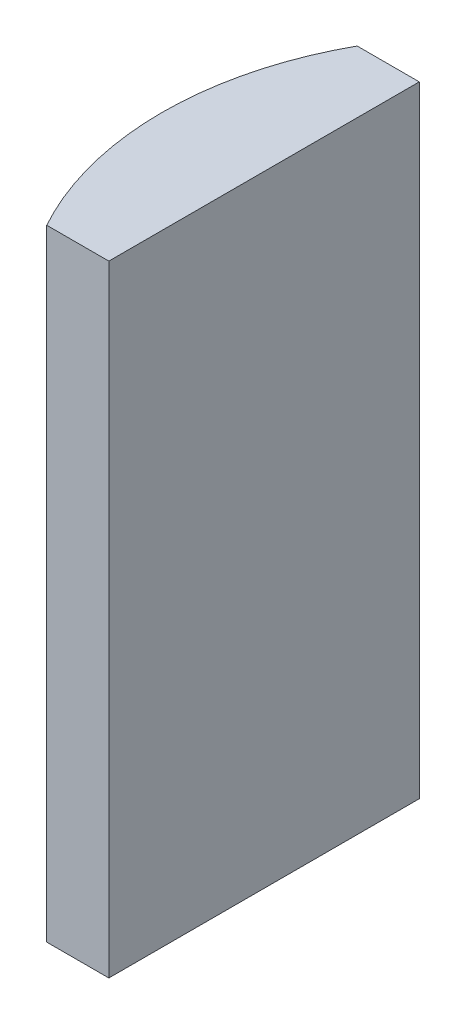
ISO-10303-21;
HEADER;
FILE_DESCRIPTION(('STEP AP214'),'2;1');
FILE_NAME('part.step','',(''),(''),'','','');
FILE_SCHEMA(('AUTOMOTIVE_DESIGN { 1 0 10303 214 1 1 1 1 }'));
ENDSEC;
DATA;
#1=APPLICATION_CONTEXT('core data for automotive mechanical design processes');
#2=APPLICATION_PROTOCOL_DEFINITION('international standard','automotive_design',2000,#1);
#3=PRODUCT_CONTEXT('',#1,'mechanical');
#4=PRODUCT('Part','Part','',(#3));
#5=PRODUCT_RELATED_PRODUCT_CATEGORY('part','',(#4));
#6=PRODUCT_DEFINITION_FORMATION('','',#4);
#7=PRODUCT_DEFINITION_CONTEXT('part definition',#1,'design');
#8=PRODUCT_DEFINITION('design','',#6,#7);
#9=PRODUCT_DEFINITION_SHAPE('','',#8);
#10=(LENGTH_UNIT() NAMED_UNIT(*) SI_UNIT(.MILLI.,.METRE.));
#11=(NAMED_UNIT(*) PLANE_ANGLE_UNIT() SI_UNIT($,.RADIAN.));
#12=(NAMED_UNIT(*) SI_UNIT($,.STERADIAN.) SOLID_ANGLE_UNIT());
#13=UNCERTAINTY_MEASURE_WITH_UNIT(LENGTH_MEASURE(1.E-05),#10,'distance_accuracy_value','');
#14=(GEOMETRIC_REPRESENTATION_CONTEXT(3) GLOBAL_UNCERTAINTY_ASSIGNED_CONTEXT((#13)) GLOBAL_UNIT_ASSIGNED_CONTEXT((#10,
#11,#12)) REPRESENTATION_CONTEXT('',''));
#15=CARTESIAN_POINT('',(0.,0.,0.));
#16=DIRECTION('',(0.,0.,1.));
#17=DIRECTION('',(1.,0.,0.));
#18=AXIS2_PLACEMENT_3D('',#15,#16,#17);
#19=CARTESIAN_POINT('',(4.35520433485127,20.,0.));
#20=DIRECTION('',(0.,-1.,0.));
#21=DIRECTION('',(0.,0.,-1.));
#22=AXIS2_PLACEMENT_3D('',#19,#20,#21);
#23=CYLINDRICAL_SURFACE('',#22,10.34);
#24=CARTESIAN_POINT('',(4.35520433485127,0.,0.));
#25=DIRECTION('',(0.,1.,0.));
#26=DIRECTION('',(0.,0.,1.));
#27=AXIS2_PLACEMENT_3D('',#24,#25,#26);
#28=CIRCLE('',#27,10.34);
#29=CARTESIAN_POINT('',(-4.69551939311657,0.,-5.));
#30=VERTEX_POINT('',#29);
#31=CARTESIAN_POINT('',(-4.69551939311657,0.,5.));
#32=VERTEX_POINT('',#31);
#33=EDGE_CURVE('E100',#30,#32,#28,.T.);
#34=ORIENTED_EDGE('',*,*,#33,.T.);
#35=DIRECTION('',(0.,-1.,0.));
#36=VECTOR('',#35,1.);
#37=CARTESIAN_POINT('',(-4.69551939311657,20.,5.));
#38=LINE('',#37,#36);
#39=CARTESIAN_POINT('',(-4.69551939311657,20.,5.));
#40=VERTEX_POINT('',#39);
#41=EDGE_CURVE('E11',#40,#32,#38,.T.);
#42=ORIENTED_EDGE('',*,*,#41,.F.);
#43=CARTESIAN_POINT('',(4.35520433485127,20.,0.));
#44=DIRECTION('',(0.,1.,0.));
#45=DIRECTION('',(0.,0.,1.));
#46=AXIS2_PLACEMENT_3D('',#43,#44,#45);
#47=CIRCLE('',#46,10.34);
#48=CARTESIAN_POINT('',(-4.69551939311657,20.,-5.));
#49=VERTEX_POINT('',#48);
#50=EDGE_CURVE('E88',#49,#40,#47,.T.);
#51=ORIENTED_EDGE('',*,*,#50,.F.);
#52=DIRECTION('',(0.,-1.,0.));
#53=VECTOR('',#52,1.);
#54=CARTESIAN_POINT('',(-4.69551939311657,20.,-5.));
#55=LINE('',#54,#53);
#56=EDGE_CURVE('E96',#49,#30,#55,.T.);
#57=ORIENTED_EDGE('',*,*,#56,.T.);
#58=EDGE_LOOP('',(#34,#42,#51,#57));
#59=FACE_BOUND('',#58,.T.);
#60=ADVANCED_FACE('F37',(#59),#23,.T.);
#61=CARTESIAN_POINT('',(-4.69551939311657,20.,5.));
#62=DIRECTION('',(0.,0.,-1.));
#63=DIRECTION('',(-1.,0.,0.));
#64=AXIS2_PLACEMENT_3D('',#61,#62,#63);
#65=PLANE('',#64);
#66=DIRECTION('',(1.,0.,0.));
#67=VECTOR('',#66,1.);
#68=CARTESIAN_POINT('',(-4.69551939311657,0.,5.));
#69=LINE('',#68,#67);
#70=CARTESIAN_POINT('',(-2.69479566514873,0.,5.));
#71=VERTEX_POINT('',#70);
#72=EDGE_CURVE('E92',#32,#71,#69,.T.);
#73=ORIENTED_EDGE('',*,*,#72,.T.);
#74=DIRECTION('',(0.,-1.,0.));
#75=VECTOR('',#74,1.);
#76=CARTESIAN_POINT('',(-2.69479566514873,20.,5.));
#77=LINE('',#76,#75);
#78=CARTESIAN_POINT('',(-2.69479566514873,20.,5.));
#79=VERTEX_POINT('',#78);
#80=EDGE_CURVE('E45',#79,#71,#77,.T.);
#81=ORIENTED_EDGE('',*,*,#80,.F.);
#82=DIRECTION('',(1.,0.,0.));
#83=VECTOR('',#82,1.);
#84=CARTESIAN_POINT('',(-4.69551939311657,20.,5.));
#85=LINE('',#84,#83);
#86=EDGE_CURVE('E83',#40,#79,#85,.T.);
#87=ORIENTED_EDGE('',*,*,#86,.F.);
#88=ORIENTED_EDGE('',*,*,#41,.T.);
#89=EDGE_LOOP('',(#73,#81,#87,#88));
#90=FACE_BOUND('',#89,.T.);
#91=ADVANCED_FACE('F91',(#90),#65,.F.);
#92=CARTESIAN_POINT('',(-2.69479566514874,20.,-5.));
#93=DIRECTION('',(-1.,0.,0.));
#94=DIRECTION('',(0.,0.,1.));
#95=AXIS2_PLACEMENT_3D('',#92,#93,#94);
#96=PLANE('',#95);
#97=DIRECTION('',(0.,0.,-1.));
#98=VECTOR('',#97,1.);
#99=CARTESIAN_POINT('',(-2.69479566514874,0.,-5.));
#100=LINE('',#99,#98);
#101=CARTESIAN_POINT('',(-2.69479566514874,0.,-5.));
#102=VERTEX_POINT('',#101);
#103=EDGE_CURVE('E70',#71,#102,#100,.T.);
#104=ORIENTED_EDGE('',*,*,#103,.T.);
#105=DIRECTION('',(0.,-1.,0.));
#106=VECTOR('',#105,1.);
#107=CARTESIAN_POINT('',(-2.69479566514874,20.,-5.));
#108=LINE('',#107,#106);
#109=CARTESIAN_POINT('',(-2.69479566514874,20.,-5.));
#110=VERTEX_POINT('',#109);
#111=EDGE_CURVE('E93',#110,#102,#108,.T.);
#112=ORIENTED_EDGE('',*,*,#111,.F.);
#113=DIRECTION('',(0.,0.,-1.));
#114=VECTOR('',#113,1.);
#115=CARTESIAN_POINT('',(-2.69479566514874,20.,-5.));
#116=LINE('',#115,#114);
#117=EDGE_CURVE('E86',#79,#110,#116,.T.);
#118=ORIENTED_EDGE('',*,*,#117,.F.);
#119=ORIENTED_EDGE('',*,*,#80,.T.);
#120=EDGE_LOOP('',(#104,#112,#118,#119));
#121=FACE_BOUND('',#120,.T.);
#122=ADVANCED_FACE('F94',(#121),#96,.F.);
#123=CARTESIAN_POINT('',(-4.69551939311657,20.,-5.));
#124=DIRECTION('',(0.,0.,1.));
#125=DIRECTION('',(1.,0.,0.));
#126=AXIS2_PLACEMENT_3D('',#123,#124,#125);
#127=PLANE('',#126);
#128=DIRECTION('',(-1.,0.,0.));
#129=VECTOR('',#128,1.);
#130=CARTESIAN_POINT('',(-4.69551939311657,0.,-5.));
#131=LINE('',#130,#129);
#132=EDGE_CURVE('E76',#102,#30,#131,.T.);
#133=ORIENTED_EDGE('',*,*,#132,.T.);
#134=ORIENTED_EDGE('',*,*,#56,.F.);
#135=DIRECTION('',(-1.,0.,0.));
#136=VECTOR('',#135,1.);
#137=CARTESIAN_POINT('',(-4.69551939311657,20.,-5.));
#138=LINE('',#137,#136);
#139=EDGE_CURVE('E53',#110,#49,#138,.T.);
#140=ORIENTED_EDGE('',*,*,#139,.F.);
#141=ORIENTED_EDGE('',*,*,#111,.T.);
#142=EDGE_LOOP('',(#133,#134,#140,#141));
#143=FACE_BOUND('',#142,.T.);
#144=ADVANCED_FACE('F107',(#143),#127,.F.);
#145=CARTESIAN_POINT('',(4.35520433485127,20.,0.));
#146=DIRECTION('',(0.,1.,0.));
#147=DIRECTION('',(0.,0.,1.));
#148=AXIS2_PLACEMENT_3D('',#145,#146,#147);
#149=PLANE('',#148);
#150=ORIENTED_EDGE('',*,*,#50,.T.);
#151=ORIENTED_EDGE('',*,*,#86,.T.);
#152=ORIENTED_EDGE('',*,*,#117,.T.);
#153=ORIENTED_EDGE('',*,*,#139,.T.);
#154=EDGE_LOOP('',(#150,#151,#152,#153));
#155=FACE_BOUND('',#154,.T.);
#156=ADVANCED_FACE('F84',(#155),#149,.T.);
#157=CARTESIAN_POINT('',(4.35520433485127,0.,0.));
#158=DIRECTION('',(0.,1.,0.));
#159=DIRECTION('',(0.,0.,1.));
#160=AXIS2_PLACEMENT_3D('',#157,#158,#159);
#161=PLANE('',#160);
#162=ORIENTED_EDGE('',*,*,#33,.F.);
#163=ORIENTED_EDGE('',*,*,#132,.F.);
#164=ORIENTED_EDGE('',*,*,#103,.F.);
#165=ORIENTED_EDGE('',*,*,#72,.F.);
#166=EDGE_LOOP('',(#162,#163,#164,#165));
#167=FACE_BOUND('',#166,.T.);
#168=ADVANCED_FACE('F110',(#167),#161,.F.);
#169=CLOSED_SHELL('',(#60,#91,#122,#144,#156,#168));
#170=MANIFOLD_SOLID_BREP('B2',#169);
#171=ADVANCED_BREP_SHAPE_REPRESENTATION('',(#18,#170),#14);
#172=SHAPE_DEFINITION_REPRESENTATION(#9,#171);
ENDSEC;
END-ISO-10303-21;
